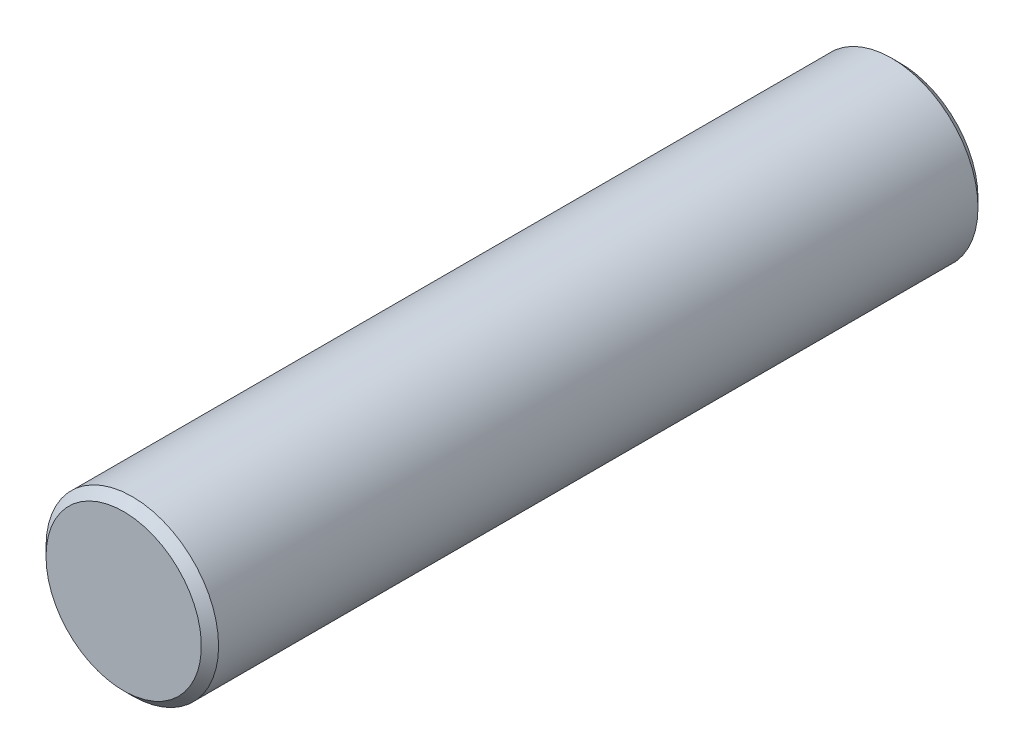
ISO-10303-21;
HEADER;
FILE_DESCRIPTION(('STEP AP214'),'2;1');
FILE_NAME('part.step','',(''),(''),'','','');
FILE_SCHEMA(('AUTOMOTIVE_DESIGN { 1 0 10303 214 1 1 1 1 }'));
ENDSEC;
DATA;
#1=APPLICATION_CONTEXT('core data for automotive mechanical design processes');
#2=APPLICATION_PROTOCOL_DEFINITION('international standard','automotive_design',2000,#1);
#3=PRODUCT_CONTEXT('',#1,'mechanical');
#4=PRODUCT('Part','Part','',(#3));
#5=PRODUCT_RELATED_PRODUCT_CATEGORY('part','',(#4));
#6=PRODUCT_DEFINITION_FORMATION('','',#4);
#7=PRODUCT_DEFINITION_CONTEXT('part definition',#1,'design');
#8=PRODUCT_DEFINITION('design','',#6,#7);
#9=PRODUCT_DEFINITION_SHAPE('','',#8);
#10=(LENGTH_UNIT() NAMED_UNIT(*) SI_UNIT(.MILLI.,.METRE.));
#11=(NAMED_UNIT(*) PLANE_ANGLE_UNIT() SI_UNIT($,.RADIAN.));
#12=(NAMED_UNIT(*) SI_UNIT($,.STERADIAN.) SOLID_ANGLE_UNIT());
#13=UNCERTAINTY_MEASURE_WITH_UNIT(LENGTH_MEASURE(1.E-05),#10,'distance_accuracy_value','');
#14=(GEOMETRIC_REPRESENTATION_CONTEXT(3) GLOBAL_UNCERTAINTY_ASSIGNED_CONTEXT((#13)) GLOBAL_UNIT_ASSIGNED_CONTEXT((#10,
#11,#12)) REPRESENTATION_CONTEXT('',''));
#15=CARTESIAN_POINT('',(0.,0.,0.));
#16=DIRECTION('',(0.,0.,1.));
#17=DIRECTION('',(1.,0.,0.));
#18=AXIS2_PLACEMENT_3D('',#15,#16,#17);
#19=CARTESIAN_POINT('',(0.,0.,22.5));
#20=DIRECTION('',(0.,0.,-1.));
#21=DIRECTION('',(-1.,0.,0.));
#22=AXIS2_PLACEMENT_3D('',#19,#20,#21);
#23=PLANE('',#22);
#24=CARTESIAN_POINT('',(0.,0.,22.5));
#25=DIRECTION('',(0.,0.,-1.));
#26=DIRECTION('',(-1.,0.,0.));
#27=AXIS2_PLACEMENT_3D('',#24,#25,#26);
#28=CIRCLE('',#27,4.49999999999999);
#29=CARTESIAN_POINT('',(-4.49999999999999,0.,22.5));
#30=VERTEX_POINT('',#29);
#31=EDGE_CURVE('E10',#30,#30,#28,.F.);
#32=ORIENTED_EDGE('',*,*,#31,.T.);
#33=EDGE_LOOP('',(#32));
#34=FACE_BOUND('',#33,.T.);
#35=ADVANCED_FACE('F33',(#34),#23,.F.);
#36=CARTESIAN_POINT('',(0.,0.,258.883884113946));
#37=DIRECTION('',(0.,0.,1.));
#38=DIRECTION('',(1.,0.,0.));
#39=AXIS2_PLACEMENT_3D('',#36,#37,#38);
#40=CYLINDRICAL_SURFACE('',#39,5.);
#41=CARTESIAN_POINT('',(0.,0.,-22.));
#42=DIRECTION('',(0.,0.,1.));
#43=DIRECTION('',(1.,0.,0.));
#44=AXIS2_PLACEMENT_3D('',#41,#42,#43);
#45=CIRCLE('',#44,5.);
#46=CARTESIAN_POINT('',(5.,0.,-22.));
#47=VERTEX_POINT('',#46);
#48=EDGE_CURVE('E45',#47,#47,#45,.T.);
#49=ORIENTED_EDGE('',*,*,#48,.T.);
#50=EDGE_LOOP('',(#49));
#51=FACE_BOUND('',#50,.T.);
#52=CARTESIAN_POINT('',(0.,0.,22.));
#53=DIRECTION('',(0.,0.,-1.));
#54=DIRECTION('',(-1.,0.,0.));
#55=AXIS2_PLACEMENT_3D('',#52,#53,#54);
#56=CIRCLE('',#55,5.);
#57=CARTESIAN_POINT('',(-5.,0.,22.));
#58=VERTEX_POINT('',#57);
#59=EDGE_CURVE('E49',#58,#58,#56,.T.);
#60=ORIENTED_EDGE('',*,*,#59,.T.);
#61=EDGE_LOOP('',(#60));
#62=FACE_BOUND('',#61,.T.);
#63=ADVANCED_FACE('F55',(#51,#62),#40,.T.);
#64=CARTESIAN_POINT('',(0.,5.00000000000001,-22.5));
#65=DIRECTION('',(0.,0.,1.));
#66=DIRECTION('',(1.,0.,0.));
#67=AXIS2_PLACEMENT_3D('',#64,#65,#66);
#68=PLANE('',#67);
#69=CARTESIAN_POINT('',(0.,0.,-22.5));
#70=DIRECTION('',(0.,0.,1.));
#71=DIRECTION('',(1.,0.,0.));
#72=AXIS2_PLACEMENT_3D('',#69,#70,#71);
#73=CIRCLE('',#72,4.50000000000003);
#74=CARTESIAN_POINT('',(4.50000000000003,0.,-22.5));
#75=VERTEX_POINT('',#74);
#76=EDGE_CURVE('E41',#75,#75,#73,.F.);
#77=ORIENTED_EDGE('',*,*,#76,.T.);
#78=EDGE_LOOP('',(#77));
#79=FACE_BOUND('',#78,.T.);
#80=ADVANCED_FACE('F63',(#79),#68,.F.);
#81=CARTESIAN_POINT('',(0.,0.,-22.));
#82=DIRECTION('',(0.,0.,1.));
#83=DIRECTION('',(1.,0.,0.));
#84=AXIS2_PLACEMENT_3D('',#81,#82,#83);
#85=CONICAL_SURFACE('',#84,5.,0.785398163397441);
#86=ORIENTED_EDGE('',*,*,#76,.F.);
#87=EDGE_LOOP('',(#86));
#88=FACE_BOUND('',#87,.T.);
#89=ORIENTED_EDGE('',*,*,#48,.F.);
#90=EDGE_LOOP('',(#89));
#91=FACE_BOUND('',#90,.T.);
#92=ADVANCED_FACE('F59',(#88,#91),#85,.T.);
#93=CARTESIAN_POINT('',(0.,0.,22.5));
#94=DIRECTION('',(0.,0.,-1.));
#95=DIRECTION('',(-1.,0.,0.));
#96=AXIS2_PLACEMENT_3D('',#93,#94,#95);
#97=CONICAL_SURFACE('',#96,4.5,0.785398163397455);
#98=ORIENTED_EDGE('',*,*,#59,.F.);
#99=EDGE_LOOP('',(#98));
#100=FACE_BOUND('',#99,.T.);
#101=ORIENTED_EDGE('',*,*,#31,.F.);
#102=EDGE_LOOP('',(#101));
#103=FACE_BOUND('',#102,.T.);
#104=ADVANCED_FACE('F36',(#100,#103),#97,.T.);
#105=CLOSED_SHELL('',(#35,#63,#80,#92,#104));
#106=MANIFOLD_SOLID_BREP('B2',#105);
#107=ADVANCED_BREP_SHAPE_REPRESENTATION('',(#18,#106),#14);
#108=SHAPE_DEFINITION_REPRESENTATION(#9,#107);
ENDSEC;
END-ISO-10303-21;
